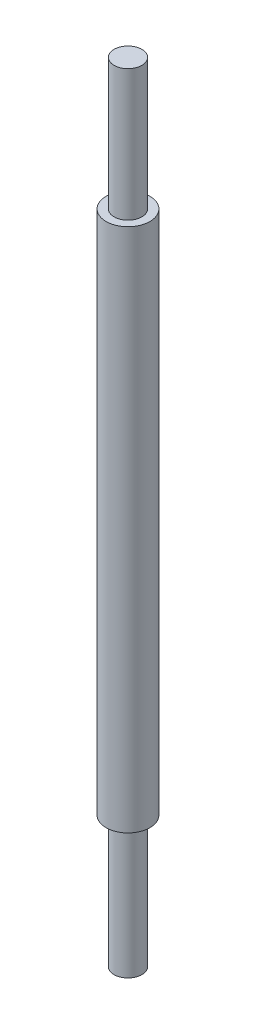
ISO-10303-21;
HEADER;
FILE_DESCRIPTION(('STEP AP214'),'2;1');
FILE_NAME('part.step','',(''),(''),'','','');
FILE_SCHEMA(('AUTOMOTIVE_DESIGN { 1 0 10303 214 1 1 1 1 }'));
ENDSEC;
DATA;
#1=APPLICATION_CONTEXT('core data for automotive mechanical design processes');
#2=APPLICATION_PROTOCOL_DEFINITION('international standard','automotive_design',2000,#1);
#3=PRODUCT_CONTEXT('',#1,'mechanical');
#4=PRODUCT('Part','Part','',(#3));
#5=PRODUCT_RELATED_PRODUCT_CATEGORY('part','',(#4));
#6=PRODUCT_DEFINITION_FORMATION('','',#4);
#7=PRODUCT_DEFINITION_CONTEXT('part definition',#1,'design');
#8=PRODUCT_DEFINITION('design','',#6,#7);
#9=PRODUCT_DEFINITION_SHAPE('','',#8);
#10=(LENGTH_UNIT() NAMED_UNIT(*) SI_UNIT(.MILLI.,.METRE.));
#11=(NAMED_UNIT(*) PLANE_ANGLE_UNIT() SI_UNIT($,.RADIAN.));
#12=(NAMED_UNIT(*) SI_UNIT($,.STERADIAN.) SOLID_ANGLE_UNIT());
#13=UNCERTAINTY_MEASURE_WITH_UNIT(LENGTH_MEASURE(1.E-05),#10,'distance_accuracy_value','');
#14=(GEOMETRIC_REPRESENTATION_CONTEXT(3) GLOBAL_UNCERTAINTY_ASSIGNED_CONTEXT((#13)) GLOBAL_UNIT_ASSIGNED_CONTEXT((#10,
#11,#12)) REPRESENTATION_CONTEXT('',''));
#15=CARTESIAN_POINT('',(0.,0.,0.));
#16=DIRECTION('',(0.,0.,1.));
#17=DIRECTION('',(1.,0.,0.));
#18=AXIS2_PLACEMENT_3D('',#15,#16,#17);
#19=CARTESIAN_POINT('',(0.,90.,0.));
#20=DIRECTION('',(0.,-1.,0.));
#21=DIRECTION('',(0.,0.,-1.));
#22=AXIS2_PLACEMENT_3D('',#19,#20,#21);
#23=CYLINDRICAL_SURFACE('',#22,3.175);
#24=CARTESIAN_POINT('',(0.,60.,0.));
#25=DIRECTION('',(0.,1.,0.));
#26=DIRECTION('',(0.,0.,1.));
#27=AXIS2_PLACEMENT_3D('',#24,#25,#26);
#28=CIRCLE('',#27,3.175);
#29=CARTESIAN_POINT('',(0.,60.,3.175));
#30=VERTEX_POINT('',#29);
#31=EDGE_CURVE('E51',#30,#30,#28,.T.);
#32=ORIENTED_EDGE('',*,*,#31,.T.);
#33=EDGE_LOOP('',(#32));
#34=FACE_BOUND('',#33,.T.);
#35=CARTESIAN_POINT('',(0.,90.,0.));
#36=DIRECTION('',(0.,1.,0.));
#37=DIRECTION('',(0.,0.,1.));
#38=AXIS2_PLACEMENT_3D('',#35,#36,#37);
#39=CIRCLE('',#38,3.175);
#40=CARTESIAN_POINT('',(0.,90.,3.175));
#41=VERTEX_POINT('',#40);
#42=EDGE_CURVE('E37',#41,#41,#39,.T.);
#43=ORIENTED_EDGE('',*,*,#42,.F.);
#44=EDGE_LOOP('',(#43));
#45=FACE_BOUND('',#44,.T.);
#46=ADVANCED_FACE('F31',(#34,#45),#23,.T.);
#47=CARTESIAN_POINT('',(0.,90.,0.));
#48=DIRECTION('',(0.,1.,0.));
#49=DIRECTION('',(0.,0.,1.));
#50=AXIS2_PLACEMENT_3D('',#47,#48,#49);
#51=PLANE('',#50);
#52=ORIENTED_EDGE('',*,*,#42,.T.);
#53=EDGE_LOOP('',(#52));
#54=FACE_BOUND('',#53,.T.);
#55=ADVANCED_FACE('F62',(#54),#51,.T.);
#56=CARTESIAN_POINT('',(0.,60.,0.));
#57=DIRECTION('',(0.,1.,0.));
#58=DIRECTION('',(0.,0.,1.));
#59=AXIS2_PLACEMENT_3D('',#56,#57,#58);
#60=PLANE('',#59);
#61=CARTESIAN_POINT('',(0.,60.,0.));
#62=DIRECTION('',(0.,1.,0.));
#63=DIRECTION('',(0.,0.,1.));
#64=AXIS2_PLACEMENT_3D('',#61,#62,#63);
#65=CIRCLE('',#64,5.);
#66=CARTESIAN_POINT('',(0.,60.,5.));
#67=VERTEX_POINT('',#66);
#68=EDGE_CURVE('E46',#67,#67,#65,.T.);
#69=ORIENTED_EDGE('',*,*,#68,.T.);
#70=EDGE_LOOP('',(#69));
#71=FACE_BOUND('',#70,.T.);
#72=ORIENTED_EDGE('',*,*,#31,.F.);
#73=EDGE_LOOP('',(#72));
#74=FACE_BOUND('',#73,.T.);
#75=ADVANCED_FACE('F59',(#71,#74),#60,.T.);
#76=CARTESIAN_POINT('',(0.,-60.,0.));
#77=DIRECTION('',(0.,1.,0.));
#78=DIRECTION('',(0.,0.,1.));
#79=AXIS2_PLACEMENT_3D('',#76,#77,#78);
#80=PLANE('',#79);
#81=CARTESIAN_POINT('',(0.,-60.,0.));
#82=DIRECTION('',(0.,1.,0.));
#83=DIRECTION('',(0.,0.,1.));
#84=AXIS2_PLACEMENT_3D('',#81,#82,#83);
#85=CIRCLE('',#84,5.);
#86=CARTESIAN_POINT('',(0.,-60.,5.));
#87=VERTEX_POINT('',#86);
#88=EDGE_CURVE('E48',#87,#87,#85,.T.);
#89=ORIENTED_EDGE('',*,*,#88,.F.);
#90=EDGE_LOOP('',(#89));
#91=FACE_BOUND('',#90,.T.);
#92=CARTESIAN_POINT('',(0.,-60.,0.));
#93=DIRECTION('',(0.,1.,0.));
#94=DIRECTION('',(0.,0.,1.));
#95=AXIS2_PLACEMENT_3D('',#92,#93,#94);
#96=CIRCLE('',#95,3.175);
#97=CARTESIAN_POINT('',(0.,-60.,3.175));
#98=VERTEX_POINT('',#97);
#99=EDGE_CURVE('E10',#98,#98,#96,.T.);
#100=ORIENTED_EDGE('',*,*,#99,.T.);
#101=EDGE_LOOP('',(#100));
#102=FACE_BOUND('',#101,.T.);
#103=ADVANCED_FACE('F61',(#91,#102),#80,.F.);
#104=CARTESIAN_POINT('',(0.,60.,0.));
#105=DIRECTION('',(0.,-1.,0.));
#106=DIRECTION('',(0.,0.,-1.));
#107=AXIS2_PLACEMENT_3D('',#104,#105,#106);
#108=CYLINDRICAL_SURFACE('',#107,5.);
#109=ORIENTED_EDGE('',*,*,#68,.F.);
#110=EDGE_LOOP('',(#109));
#111=FACE_BOUND('',#110,.T.);
#112=ORIENTED_EDGE('',*,*,#88,.T.);
#113=EDGE_LOOP('',(#112));
#114=FACE_BOUND('',#113,.T.);
#115=ADVANCED_FACE('F69',(#111,#114),#108,.T.);
#116=CARTESIAN_POINT('',(0.,-90.,0.));
#117=DIRECTION('',(0.,1.,0.));
#118=DIRECTION('',(0.,0.,1.));
#119=AXIS2_PLACEMENT_3D('',#116,#117,#118);
#120=PLANE('',#119);
#121=CARTESIAN_POINT('',(0.,-90.,0.));
#122=DIRECTION('',(0.,1.,0.));
#123=DIRECTION('',(0.,0.,1.));
#124=AXIS2_PLACEMENT_3D('',#121,#122,#123);
#125=CIRCLE('',#124,3.175);
#126=CARTESIAN_POINT('',(0.,-90.,3.175));
#127=VERTEX_POINT('',#126);
#128=EDGE_CURVE('E41',#127,#127,#125,.T.);
#129=ORIENTED_EDGE('',*,*,#128,.F.);
#130=EDGE_LOOP('',(#129));
#131=FACE_BOUND('',#130,.T.);
#132=ADVANCED_FACE('F78',(#131),#120,.F.);
#133=ORIENTED_EDGE('',*,*,#128,.T.);
#134=EDGE_LOOP('',(#133));
#135=FACE_BOUND('',#134,.T.);
#136=ORIENTED_EDGE('',*,*,#99,.F.);
#137=EDGE_LOOP('',(#136));
#138=FACE_BOUND('',#137,.T.);
#139=ADVANCED_FACE('F74',(#135,#138),#23,.T.);
#140=CLOSED_SHELL('',(#46,#55,#75,#103,#115,#132,#139));
#141=MANIFOLD_SOLID_BREP('B2',#140);
#142=ADVANCED_BREP_SHAPE_REPRESENTATION('',(#18,#141),#14);
#143=SHAPE_DEFINITION_REPRESENTATION(#9,#142);
ENDSEC;
END-ISO-10303-21;
